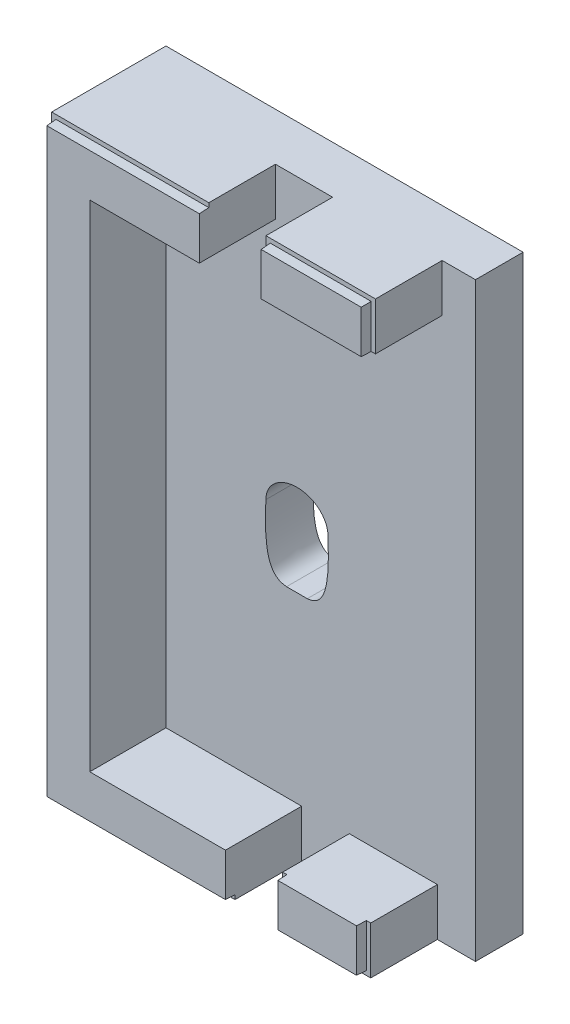
ISO-10303-21;
HEADER;
FILE_DESCRIPTION(('STEP AP214'),'2;1');
FILE_NAME('part.step','',(''),(''),'','','');
FILE_SCHEMA(('AUTOMOTIVE_DESIGN { 1 0 10303 214 1 1 1 1 }'));
ENDSEC;
DATA;
#1=APPLICATION_CONTEXT('core data for automotive mechanical design processes');
#2=APPLICATION_PROTOCOL_DEFINITION('international standard','automotive_design',2000,#1);
#3=PRODUCT_CONTEXT('',#1,'mechanical');
#4=PRODUCT('Part','Part','',(#3));
#5=PRODUCT_RELATED_PRODUCT_CATEGORY('part','',(#4));
#6=PRODUCT_DEFINITION_FORMATION('','',#4);
#7=PRODUCT_DEFINITION_CONTEXT('part definition',#1,'design');
#8=PRODUCT_DEFINITION('design','',#6,#7);
#9=PRODUCT_DEFINITION_SHAPE('','',#8);
#10=(LENGTH_UNIT() NAMED_UNIT(*) SI_UNIT(.MILLI.,.METRE.));
#11=(NAMED_UNIT(*) PLANE_ANGLE_UNIT() SI_UNIT($,.RADIAN.));
#12=(NAMED_UNIT(*) SI_UNIT($,.STERADIAN.) SOLID_ANGLE_UNIT());
#13=UNCERTAINTY_MEASURE_WITH_UNIT(LENGTH_MEASURE(1.E-05),#10,'distance_accuracy_value','');
#14=(GEOMETRIC_REPRESENTATION_CONTEXT(3) GLOBAL_UNCERTAINTY_ASSIGNED_CONTEXT((#13)) GLOBAL_UNIT_ASSIGNED_CONTEXT((#10,
#11,#12)) REPRESENTATION_CONTEXT('',''));
#15=CARTESIAN_POINT('',(0.,0.,0.));
#16=DIRECTION('',(0.,0.,1.));
#17=DIRECTION('',(1.,0.,0.));
#18=AXIS2_PLACEMENT_3D('',#15,#16,#17);
#19=CARTESIAN_POINT('',(0.,0.,10.));
#20=DIRECTION('',(0.,1.,0.));
#21=DIRECTION('',(0.,0.,1.));
#22=AXIS2_PLACEMENT_3D('',#19,#20,#21);
#23=PLANE('',#22);
#24=DIRECTION('',(1.,0.,0.));
#25=VECTOR('',#24,1.);
#26=CARTESIAN_POINT('',(0.,0.,24.));
#27=LINE('',#26,#25);
#28=CARTESIAN_POINT('',(0.,0.,24.));
#29=VERTEX_POINT('',#28);
#30=CARTESIAN_POINT('',(38.5,0.,24.));
#31=VERTEX_POINT('',#30);
#32=EDGE_CURVE('E293',#29,#31,#27,.T.);
#33=ORIENTED_EDGE('',*,*,#32,.F.);
#34=DIRECTION('',(0.,0.,-1.));
#35=VECTOR('',#34,1.);
#36=CARTESIAN_POINT('',(0.,0.,10.));
#37=LINE('',#36,#35);
#38=CARTESIAN_POINT('',(0.,0.,0.));
#39=VERTEX_POINT('',#38);
#40=EDGE_CURVE('E395',#29,#39,#37,.T.);
#41=ORIENTED_EDGE('',*,*,#40,.T.);
#42=DIRECTION('',(1.,0.,0.));
#43=VECTOR('',#42,1.);
#44=CARTESIAN_POINT('',(0.,0.,0.));
#45=LINE('',#44,#43);
#46=CARTESIAN_POINT('',(75.,0.,0.));
#47=VERTEX_POINT('',#46);
#48=EDGE_CURVE('E682',#39,#47,#45,.T.);
#49=ORIENTED_EDGE('',*,*,#48,.T.);
#50=DIRECTION('',(0.,0.,-1.));
#51=VECTOR('',#50,1.);
#52=CARTESIAN_POINT('',(75.,0.,10.));
#53=LINE('',#52,#51);
#54=CARTESIAN_POINT('',(75.,0.,10.));
#55=VERTEX_POINT('',#54);
#56=EDGE_CURVE('E567',#55,#47,#53,.T.);
#57=ORIENTED_EDGE('',*,*,#56,.F.);
#58=DIRECTION('',(1.,0.,0.));
#59=VECTOR('',#58,1.);
#60=CARTESIAN_POINT('',(0.,0.,10.));
#61=LINE('',#60,#59);
#62=CARTESIAN_POINT('',(67.,0.,10.));
#63=VERTEX_POINT('',#62);
#64=EDGE_CURVE('E565',#63,#55,#61,.T.);
#65=ORIENTED_EDGE('',*,*,#64,.F.);
#66=DIRECTION('',(0.,0.,-1.));
#67=VECTOR('',#66,1.);
#68=CARTESIAN_POINT('',(67.,0.,52.));
#69=LINE('',#68,#67);
#70=CARTESIAN_POINT('',(67.,0.,24.));
#71=VERTEX_POINT('',#70);
#72=EDGE_CURVE('E504',#71,#63,#69,.T.);
#73=ORIENTED_EDGE('',*,*,#72,.F.);
#74=DIRECTION('',(1.,0.,0.));
#75=VECTOR('',#74,1.);
#76=CARTESIAN_POINT('',(0.,0.,24.));
#77=LINE('',#76,#75);
#78=CARTESIAN_POINT('',(48.5,0.,24.));
#79=VERTEX_POINT('',#78);
#80=EDGE_CURVE('E307',#79,#71,#77,.T.);
#81=ORIENTED_EDGE('',*,*,#80,.F.);
#82=DIRECTION('',(0.,0.,-1.));
#83=VECTOR('',#82,1.);
#84=CARTESIAN_POINT('',(48.5,0.,52.));
#85=LINE('',#84,#83);
#86=CARTESIAN_POINT('',(48.5,0.,10.));
#87=VERTEX_POINT('',#86);
#88=EDGE_CURVE('E512',#79,#87,#85,.T.);
#89=ORIENTED_EDGE('',*,*,#88,.T.);
#90=CARTESIAN_POINT('',(38.5,0.,10.));
#91=VERTEX_POINT('',#90);
#92=EDGE_CURVE('E562',#91,#87,#61,.T.);
#93=ORIENTED_EDGE('',*,*,#92,.F.);
#94=DIRECTION('',(0.,0.,-1.));
#95=VECTOR('',#94,1.);
#96=CARTESIAN_POINT('',(38.5,0.,52.));
#97=LINE('',#96,#95);
#98=EDGE_CURVE('E587',#31,#91,#97,.T.);
#99=ORIENTED_EDGE('',*,*,#98,.F.);
#100=EDGE_LOOP('',(#33,#41,#49,#57,#65,#73,#81,#89,#93,#99));
#101=FACE_BOUND('',#100,.T.);
#102=ADVANCED_FACE('F35',(#101),#23,.F.);
#103=CARTESIAN_POINT('',(0.,124.,10.));
#104=DIRECTION('',(0.,1.,0.));
#105=DIRECTION('',(0.,0.,1.));
#106=AXIS2_PLACEMENT_3D('',#103,#104,#105);
#107=PLANE('',#106);
#108=DIRECTION('',(0.,0.,-1.));
#109=VECTOR('',#108,1.);
#110=CARTESIAN_POINT('',(0.,124.,10.));
#111=LINE('',#110,#109);
#112=CARTESIAN_POINT('',(0.,124.,24.));
#113=VERTEX_POINT('',#112);
#114=CARTESIAN_POINT('',(0.,124.,0.));
#115=VERTEX_POINT('',#114);
#116=EDGE_CURVE('E556',#113,#115,#111,.T.);
#117=ORIENTED_EDGE('',*,*,#116,.F.);
#118=DIRECTION('',(1.,0.,0.));
#119=VECTOR('',#118,1.);
#120=CARTESIAN_POINT('',(0.,124.,24.));
#121=LINE('',#120,#119);
#122=CARTESIAN_POINT('',(33.,124.,24.));
#123=VERTEX_POINT('',#122);
#124=EDGE_CURVE('E274',#113,#123,#121,.T.);
#125=ORIENTED_EDGE('',*,*,#124,.T.);
#126=DIRECTION('',(0.,0.,-1.));
#127=VECTOR('',#126,1.);
#128=CARTESIAN_POINT('',(33.,124.,39.));
#129=LINE('',#128,#127);
#130=CARTESIAN_POINT('',(33.,124.,10.));
#131=VERTEX_POINT('',#130);
#132=EDGE_CURVE('E548',#123,#131,#129,.T.);
#133=ORIENTED_EDGE('',*,*,#132,.T.);
#134=DIRECTION('',(1.,0.,0.));
#135=VECTOR('',#134,1.);
#136=CARTESIAN_POINT('',(0.,124.,10.));
#137=LINE('',#136,#135);
#138=CARTESIAN_POINT('',(45.,124.,10.));
#139=VERTEX_POINT('',#138);
#140=EDGE_CURVE('E676',#131,#139,#137,.T.);
#141=ORIENTED_EDGE('',*,*,#140,.T.);
#142=DIRECTION('',(0.,0.,-1.));
#143=VECTOR('',#142,1.);
#144=CARTESIAN_POINT('',(45.,124.,39.));
#145=LINE('',#144,#143);
#146=CARTESIAN_POINT('',(45.,124.,24.));
#147=VERTEX_POINT('',#146);
#148=EDGE_CURVE('E502',#147,#139,#145,.T.);
#149=ORIENTED_EDGE('',*,*,#148,.F.);
#150=DIRECTION('',(-1.,0.,0.));
#151=VECTOR('',#150,1.);
#152=CARTESIAN_POINT('',(0.,124.,24.));
#153=LINE('',#152,#151);
#154=CARTESIAN_POINT('',(68.,124.,24.));
#155=VERTEX_POINT('',#154);
#156=EDGE_CURVE('E355',#155,#147,#153,.T.);
#157=ORIENTED_EDGE('',*,*,#156,.F.);
#158=DIRECTION('',(0.,0.,-1.));
#159=VECTOR('',#158,1.);
#160=CARTESIAN_POINT('',(68.,124.,39.));
#161=LINE('',#160,#159);
#162=CARTESIAN_POINT('',(68.,124.,10.));
#163=VERTEX_POINT('',#162);
#164=EDGE_CURVE('E1131',#155,#163,#161,.T.);
#165=ORIENTED_EDGE('',*,*,#164,.T.);
#166=CARTESIAN_POINT('',(75.,124.,10.));
#167=VERTEX_POINT('',#166);
#168=EDGE_CURVE('E681',#163,#167,#137,.T.);
#169=ORIENTED_EDGE('',*,*,#168,.T.);
#170=DIRECTION('',(0.,0.,-1.));
#171=VECTOR('',#170,1.);
#172=CARTESIAN_POINT('',(75.,124.,10.));
#173=LINE('',#172,#171);
#174=CARTESIAN_POINT('',(75.,124.,0.));
#175=VERTEX_POINT('',#174);
#176=EDGE_CURVE('E412',#167,#175,#173,.T.);
#177=ORIENTED_EDGE('',*,*,#176,.T.);
#178=DIRECTION('',(1.,0.,0.));
#179=VECTOR('',#178,1.);
#180=CARTESIAN_POINT('',(0.,124.,0.));
#181=LINE('',#180,#179);
#182=EDGE_CURVE('E558',#115,#175,#181,.T.);
#183=ORIENTED_EDGE('',*,*,#182,.F.);
#184=EDGE_LOOP('',(#117,#125,#133,#141,#149,#157,#165,#169,#177,#183));
#185=FACE_BOUND('',#184,.T.);
#186=ADVANCED_FACE('F552',(#185),#107,.T.);
#187=CARTESIAN_POINT('',(0.,0.,26.));
#188=DIRECTION('',(0.,0.,1.));
#189=DIRECTION('',(1.,0.,0.));
#190=AXIS2_PLACEMENT_3D('',#187,#188,#189);
#191=PLANE('',#190);
#192=DIRECTION('',(0.,1.,0.));
#193=VECTOR('',#192,1.);
#194=CARTESIAN_POINT('',(33.,124.,26.));
#195=LINE('',#194,#193);
#196=CARTESIAN_POINT('',(33.,114.,26.));
#197=VERTEX_POINT('',#196);
#198=CARTESIAN_POINT('',(33.,123.,26.));
#199=VERTEX_POINT('',#198);
#200=EDGE_CURVE('E339',#197,#199,#195,.T.);
#201=ORIENTED_EDGE('',*,*,#200,.T.);
#202=DIRECTION('',(-1.,0.,0.));
#203=VECTOR('',#202,1.);
#204=CARTESIAN_POINT('',(0.,123.,26.));
#205=LINE('',#204,#203);
#206=CARTESIAN_POINT('',(0.999999999999972,123.,26.));
#207=VERTEX_POINT('',#206);
#208=EDGE_CURVE('E279',#199,#207,#205,.T.);
#209=ORIENTED_EDGE('',*,*,#208,.T.);
#210=DIRECTION('',(0.,-1.,0.));
#211=VECTOR('',#210,1.);
#212=CARTESIAN_POINT('',(1.,0.,26.));
#213=LINE('',#212,#211);
#214=CARTESIAN_POINT('',(1.,1.,26.));
#215=VERTEX_POINT('',#214);
#216=EDGE_CURVE('E266',#207,#215,#213,.T.);
#217=ORIENTED_EDGE('',*,*,#216,.T.);
#218=DIRECTION('',(-1.,0.,0.));
#219=VECTOR('',#218,1.);
#220=CARTESIAN_POINT('',(0.,1.,26.));
#221=LINE('',#220,#219);
#222=CARTESIAN_POINT('',(38.5,1.,26.));
#223=VERTEX_POINT('',#222);
#224=EDGE_CURVE('E257',#223,#215,#221,.T.);
#225=ORIENTED_EDGE('',*,*,#224,.F.);
#226=DIRECTION('',(0.,1.,0.));
#227=VECTOR('',#226,1.);
#228=CARTESIAN_POINT('',(38.5,0.,26.));
#229=LINE('',#228,#227);
#230=CARTESIAN_POINT('',(38.5,10.,26.));
#231=VERTEX_POINT('',#230);
#232=EDGE_CURVE('E518',#223,#231,#229,.T.);
#233=ORIENTED_EDGE('',*,*,#232,.T.);
#234=DIRECTION('',(-1.,0.,0.));
#235=VECTOR('',#234,1.);
#236=CARTESIAN_POINT('',(20.,10.,26.));
#237=LINE('',#236,#235);
#238=CARTESIAN_POINT('',(10.,10.,26.));
#239=VERTEX_POINT('',#238);
#240=EDGE_CURVE('E359',#231,#239,#237,.T.);
#241=ORIENTED_EDGE('',*,*,#240,.T.);
#242=DIRECTION('',(0.,1.,0.));
#243=VECTOR('',#242,1.);
#244=CARTESIAN_POINT('',(10.,124.,26.));
#245=LINE('',#244,#243);
#246=CARTESIAN_POINT('',(10.,114.,26.));
#247=VERTEX_POINT('',#246);
#248=EDGE_CURVE('E572',#239,#247,#245,.T.);
#249=ORIENTED_EDGE('',*,*,#248,.T.);
#250=CARTESIAN_POINT('',(33.,114.,26.));
#251=DIRECTION('',(-1.,0.,0.));
#252=VECTOR('',#251,1.);
#253=LINE('',#250,#252);
#254=EDGE_CURVE('E396',#197,#247,#253,.T.);
#255=ORIENTED_EDGE('',*,*,#254,.F.);
#256=EDGE_LOOP('',(#201,#209,#217,#225,#233,#241,#249,#255));
#257=FACE_BOUND('',#256,.T.);
#258=ADVANCED_FACE('F278',(#257),#191,.T.);
#259=CARTESIAN_POINT('',(0.,0.,10.));
#260=DIRECTION('',(-1.,0.,0.));
#261=DIRECTION('',(0.,-1.,0.));
#262=AXIS2_PLACEMENT_3D('',#259,#260,#261);
#263=PLANE('',#262);
#264=ORIENTED_EDGE('',*,*,#40,.F.);
#265=DIRECTION('',(0.,1.,0.));
#266=VECTOR('',#265,1.);
#267=CARTESIAN_POINT('',(0.,0.,24.));
#268=LINE('',#267,#266);
#269=EDGE_CURVE('E290',#29,#113,#268,.T.);
#270=ORIENTED_EDGE('',*,*,#269,.T.);
#271=ORIENTED_EDGE('',*,*,#116,.T.);
#272=DIRECTION('',(0.,1.,0.));
#273=VECTOR('',#272,1.);
#274=CARTESIAN_POINT('',(0.,0.,0.));
#275=LINE('',#274,#273);
#276=EDGE_CURVE('E679',#39,#115,#275,.T.);
#277=ORIENTED_EDGE('',*,*,#276,.F.);
#278=EDGE_LOOP('',(#264,#270,#271,#277));
#279=FACE_BOUND('',#278,.T.);
#280=ADVANCED_FACE('F698',(#279),#263,.T.);
#281=CARTESIAN_POINT('',(33.,124.,39.));
#282=DIRECTION('',(-1.,0.,0.));
#283=DIRECTION('',(0.,-1.,0.));
#284=AXIS2_PLACEMENT_3D('',#281,#282,#283);
#285=PLANE('',#284);
#286=DIRECTION('',(0.,-0.0523359562429438,0.998629534754574));
#287=VECTOR('',#286,1.);
#288=CARTESIAN_POINT('',(33.,122.323304041076,38.91212808826));
#289=LINE('',#288,#287);
#290=CARTESIAN_POINT('',(33.,123.104815558566,24.));
#291=VERTEX_POINT('',#290);
#292=EDGE_CURVE('E43',#199,#291,#289,.F.);
#293=ORIENTED_EDGE('',*,*,#292,.F.);
#294=ORIENTED_EDGE('',*,*,#200,.F.);
#295=DIRECTION('',(0.,0.,-1.));
#296=VECTOR('',#295,1.);
#297=CARTESIAN_POINT('',(33.,114.,39.));
#298=LINE('',#297,#296);
#299=CARTESIAN_POINT('',(33.,114.,10.));
#300=VERTEX_POINT('',#299);
#301=EDGE_CURVE('E601',#197,#300,#298,.T.);
#302=ORIENTED_EDGE('',*,*,#301,.T.);
#303=DIRECTION('',(0.,1.,0.));
#304=VECTOR('',#303,1.);
#305=CARTESIAN_POINT('',(33.,124.,10.));
#306=LINE('',#305,#304);
#307=EDGE_CURVE('E607',#300,#131,#306,.T.);
#308=ORIENTED_EDGE('',*,*,#307,.T.);
#309=ORIENTED_EDGE('',*,*,#132,.F.);
#310=DIRECTION('',(0.,1.,0.));
#311=VECTOR('',#310,1.);
#312=CARTESIAN_POINT('',(33.,124.,24.));
#313=LINE('',#312,#311);
#314=EDGE_CURVE('E539',#291,#123,#313,.T.);
#315=ORIENTED_EDGE('',*,*,#314,.F.);
#316=EDGE_LOOP('',(#293,#294,#302,#308,#309,#315));
#317=FACE_BOUND('',#316,.T.);
#318=ADVANCED_FACE('F484',(#317),#285,.F.);
#319=CARTESIAN_POINT('',(67.,0.,52.));
#320=DIRECTION('',(-1.,0.,0.));
#321=DIRECTION('',(0.,0.,1.));
#322=AXIS2_PLACEMENT_3D('',#319,#320,#321);
#323=PLANE('',#322);
#324=DIRECTION('',(0.,1.,0.));
#325=VECTOR('',#324,1.);
#326=CARTESIAN_POINT('',(67.,0.,24.));
#327=LINE('',#326,#325);
#328=CARTESIAN_POINT('',(67.,10.,24.));
#329=VERTEX_POINT('',#328);
#330=EDGE_CURVE('E319',#71,#329,#327,.T.);
#331=ORIENTED_EDGE('',*,*,#330,.F.);
#332=ORIENTED_EDGE('',*,*,#72,.T.);
#333=DIRECTION('',(0.,1.,0.));
#334=VECTOR('',#333,1.);
#335=CARTESIAN_POINT('',(67.,0.,10.));
#336=LINE('',#335,#334);
#337=CARTESIAN_POINT('',(67.,10.,10.));
#338=VERTEX_POINT('',#337);
#339=EDGE_CURVE('E652',#63,#338,#336,.T.);
#340=ORIENTED_EDGE('',*,*,#339,.T.);
#341=DIRECTION('',(0.,0.,-1.));
#342=VECTOR('',#341,1.);
#343=CARTESIAN_POINT('',(67.,10.,52.));
#344=LINE('',#343,#342);
#345=EDGE_CURVE('E511',#329,#338,#344,.T.);
#346=ORIENTED_EDGE('',*,*,#345,.F.);
#347=EDGE_LOOP('',(#331,#332,#340,#346));
#348=FACE_BOUND('',#347,.T.);
#349=ADVANCED_FACE('F480',(#348),#323,.F.);
#350=CARTESIAN_POINT('',(48.5,0.,52.));
#351=DIRECTION('',(1.,0.,0.));
#352=DIRECTION('',(0.,0.,-1.));
#353=AXIS2_PLACEMENT_3D('',#350,#351,#352);
#354=PLANE('',#353);
#355=DIRECTION('',(0.,-1.,0.));
#356=VECTOR('',#355,1.);
#357=CARTESIAN_POINT('',(48.5,0.,24.));
#358=LINE('',#357,#356);
#359=CARTESIAN_POINT('',(48.5,10.,24.));
#360=VERTEX_POINT('',#359);
#361=EDGE_CURVE('E530',#360,#79,#358,.T.);
#362=ORIENTED_EDGE('',*,*,#361,.F.);
#363=DIRECTION('',(0.,0.,-1.));
#364=VECTOR('',#363,1.);
#365=CARTESIAN_POINT('',(48.5,10.,52.));
#366=LINE('',#365,#364);
#367=CARTESIAN_POINT('',(48.5,10.,10.));
#368=VERTEX_POINT('',#367);
#369=EDGE_CURVE('E524',#360,#368,#366,.T.);
#370=ORIENTED_EDGE('',*,*,#369,.T.);
#371=DIRECTION('',(0.,-1.,0.));
#372=VECTOR('',#371,1.);
#373=CARTESIAN_POINT('',(48.5,0.,10.));
#374=LINE('',#373,#372);
#375=EDGE_CURVE('E439',#368,#87,#374,.T.);
#376=ORIENTED_EDGE('',*,*,#375,.T.);
#377=ORIENTED_EDGE('',*,*,#88,.F.);
#378=EDGE_LOOP('',(#362,#370,#376,#377));
#379=FACE_BOUND('',#378,.T.);
#380=ADVANCED_FACE('F466',(#379),#354,.F.);
#381=CARTESIAN_POINT('',(45.,124.,39.));
#382=DIRECTION('',(1.,0.,0.));
#383=DIRECTION('',(0.,0.,-1.));
#384=AXIS2_PLACEMENT_3D('',#381,#382,#383);
#385=PLANE('',#384);
#386=DIRECTION('',(0.,1.,0.));
#387=VECTOR('',#386,1.);
#388=CARTESIAN_POINT('',(45.,0.,24.));
#389=LINE('',#388,#387);
#390=CARTESIAN_POINT('',(45.,114.,24.));
#391=VERTEX_POINT('',#390);
#392=EDGE_CURVE('E334',#391,#147,#389,.T.);
#393=ORIENTED_EDGE('',*,*,#392,.T.);
#394=ORIENTED_EDGE('',*,*,#148,.T.);
#395=DIRECTION('',(0.,-1.,0.));
#396=VECTOR('',#395,1.);
#397=CARTESIAN_POINT('',(45.,124.,10.));
#398=LINE('',#397,#396);
#399=CARTESIAN_POINT('',(45.,114.,10.));
#400=VERTEX_POINT('',#399);
#401=EDGE_CURVE('E632',#139,#400,#398,.T.);
#402=ORIENTED_EDGE('',*,*,#401,.T.);
#403=DIRECTION('',(0.,0.,-1.));
#404=VECTOR('',#403,1.);
#405=CARTESIAN_POINT('',(45.,114.,39.));
#406=LINE('',#405,#404);
#407=EDGE_CURVE('E612',#391,#400,#406,.T.);
#408=ORIENTED_EDGE('',*,*,#407,.F.);
#409=EDGE_LOOP('',(#393,#394,#402,#408));
#410=FACE_BOUND('',#409,.T.);
#411=ADVANCED_FACE('F463',(#410),#385,.F.);
#412=CARTESIAN_POINT('',(68.,124.,39.));
#413=DIRECTION('',(-1.,0.,0.));
#414=DIRECTION('',(0.,0.,1.));
#415=AXIS2_PLACEMENT_3D('',#412,#413,#414);
#416=PLANE('',#415);
#417=DIRECTION('',(0.,-1.,0.));
#418=VECTOR('',#417,1.);
#419=CARTESIAN_POINT('',(68.,0.,24.));
#420=LINE('',#419,#418);
#421=CARTESIAN_POINT('',(68.,114.,24.));
#422=VERTEX_POINT('',#421);
#423=EDGE_CURVE('E338',#155,#422,#420,.T.);
#424=ORIENTED_EDGE('',*,*,#423,.T.);
#425=DIRECTION('',(0.,0.,-1.));
#426=VECTOR('',#425,1.);
#427=CARTESIAN_POINT('',(68.,114.,39.));
#428=LINE('',#427,#426);
#429=CARTESIAN_POINT('',(68.,114.,10.));
#430=VERTEX_POINT('',#429);
#431=EDGE_CURVE('E399',#422,#430,#428,.T.);
#432=ORIENTED_EDGE('',*,*,#431,.T.);
#433=DIRECTION('',(0.,1.,0.));
#434=VECTOR('',#433,1.);
#435=CARTESIAN_POINT('',(68.,124.,10.));
#436=LINE('',#435,#434);
#437=EDGE_CURVE('E642',#430,#163,#436,.T.);
#438=ORIENTED_EDGE('',*,*,#437,.T.);
#439=ORIENTED_EDGE('',*,*,#164,.F.);
#440=EDGE_LOOP('',(#424,#432,#438,#439));
#441=FACE_BOUND('',#440,.T.);
#442=ADVANCED_FACE('F459',(#441),#416,.F.);
#443=DIRECTION('',(0.,1.,0.));
#444=VECTOR('',#443,1.);
#445=CARTESIAN_POINT('',(49.5,0.,26.));
#446=LINE('',#445,#444);
#447=CARTESIAN_POINT('',(49.5,1.,26.));
#448=VERTEX_POINT('',#447);
#449=CARTESIAN_POINT('',(49.5,10.,26.));
#450=VERTEX_POINT('',#449);
#451=EDGE_CURVE('E302',#448,#450,#446,.T.);
#452=ORIENTED_EDGE('',*,*,#451,.F.);
#453=DIRECTION('',(-1.,0.,0.));
#454=VECTOR('',#453,1.);
#455=CARTESIAN_POINT('',(0.,1.,26.));
#456=LINE('',#455,#454);
#457=CARTESIAN_POINT('',(66.,1.,26.));
#458=VERTEX_POINT('',#457);
#459=EDGE_CURVE('E299',#458,#448,#456,.T.);
#460=ORIENTED_EDGE('',*,*,#459,.F.);
#461=DIRECTION('',(0.,-1.,0.));
#462=VECTOR('',#461,1.);
#463=CARTESIAN_POINT('',(66.,0.,26.));
#464=LINE('',#463,#462);
#465=CARTESIAN_POINT('',(66.,10.,26.));
#466=VERTEX_POINT('',#465);
#467=EDGE_CURVE('E297',#466,#458,#464,.T.);
#468=ORIENTED_EDGE('',*,*,#467,.F.);
#469=DIRECTION('',(-1.,0.,0.));
#470=VECTOR('',#469,1.);
#471=CARTESIAN_POINT('',(48.5,10.,26.));
#472=LINE('',#471,#470);
#473=EDGE_CURVE('E515',#466,#450,#472,.T.);
#474=ORIENTED_EDGE('',*,*,#473,.T.);
#475=EDGE_LOOP('',(#452,#460,#468,#474));
#476=FACE_BOUND('',#475,.T.);
#477=ADVANCED_FACE('F470',(#476),#191,.T.);
#478=DIRECTION('',(0.,1.,0.));
#479=VECTOR('',#478,1.);
#480=CARTESIAN_POINT('',(46.,0.,26.));
#481=LINE('',#480,#479);
#482=CARTESIAN_POINT('',(46.,114.,26.));
#483=VERTEX_POINT('',#482);
#484=CARTESIAN_POINT('',(46.,123.,26.));
#485=VERTEX_POINT('',#484);
#486=EDGE_CURVE('E360',#483,#485,#481,.T.);
#487=ORIENTED_EDGE('',*,*,#486,.F.);
#488=CARTESIAN_POINT('',(67.,114.,26.));
#489=DIRECTION('',(-1.,0.,0.));
#490=VECTOR('',#489,1.);
#491=LINE('',#488,#490);
#492=CARTESIAN_POINT('',(67.,114.,26.));
#493=VERTEX_POINT('',#492);
#494=EDGE_CURVE('E387',#493,#483,#491,.T.);
#495=ORIENTED_EDGE('',*,*,#494,.F.);
#496=DIRECTION('',(0.,-1.,0.));
#497=VECTOR('',#496,1.);
#498=CARTESIAN_POINT('',(67.,0.,26.));
#499=LINE('',#498,#497);
#500=CARTESIAN_POINT('',(67.,123.,26.));
#501=VERTEX_POINT('',#500);
#502=EDGE_CURVE('E356',#501,#493,#499,.T.);
#503=ORIENTED_EDGE('',*,*,#502,.F.);
#504=DIRECTION('',(-1.,0.,0.));
#505=VECTOR('',#504,1.);
#506=CARTESIAN_POINT('',(0.,123.,26.));
#507=LINE('',#506,#505);
#508=EDGE_CURVE('E345',#501,#485,#507,.T.);
#509=ORIENTED_EDGE('',*,*,#508,.T.);
#510=EDGE_LOOP('',(#487,#495,#503,#509));
#511=FACE_BOUND('',#510,.T.);
#512=ADVANCED_FACE('F386',(#511),#191,.T.);
#513=CARTESIAN_POINT('',(35.3205360374278,48.3282784351919,52.001));
#514=CARTESIAN_POINT('',(31.940368492597,48.6088043462592,52.001));
#515=CARTESIAN_POINT('',(30.4948835545121,51.7516643831495,52.001));
#516=CARTESIAN_POINT('',(30.9840812231567,62.,52.001));
#517=B_SPLINE_CURVE_WITH_KNOTS('',3,(#513,#514,#515,#516),.UNSPECIFIED.,.F.,.F.,(4,4),
(0.162125932616789,1.),.UNSPECIFIED.);
#518=DIRECTION('',(0.,0.,-1.));
#519=VECTOR('',#518,1.);
#520=SURFACE_OF_LINEAR_EXTRUSION('',#517,#519);
#521=CARTESIAN_POINT('',(35.3205360374278,48.3282784351919,10.));
#522=CARTESIAN_POINT('',(31.940368492597,48.6088043462592,10.));
#523=CARTESIAN_POINT('',(30.4948835545121,51.7516643831495,10.));
#524=CARTESIAN_POINT('',(30.9840812231567,62.,10.));
#525=B_SPLINE_CURVE_WITH_KNOTS('',3,(#521,#522,#523,#524),.UNSPECIFIED.,.F.,.F.,(4,4),
(0.162125932616789,1.),.UNSPECIFIED.);
#526=CARTESIAN_POINT('',(30.9840812231567,62.,10.));
#527=VERTEX_POINT('',#526);
#528=CARTESIAN_POINT('',(35.3205360374278,48.328278435192,10.));
#529=VERTEX_POINT('',#528);
#530=EDGE_CURVE('E590',#527,#529,#525,.F.);
#531=ORIENTED_EDGE('',*,*,#530,.T.);
#532=DIRECTION('',(0.,0.,-1.));
#533=VECTOR('',#532,1.);
#534=CARTESIAN_POINT('',(35.3205360374278,48.328278435192,52.001));
#535=LINE('',#534,#533);
#536=CARTESIAN_POINT('',(35.3205360374278,48.328278435192,0.));
#537=VERTEX_POINT('',#536);
#538=EDGE_CURVE('E1114',#529,#537,#535,.T.);
#539=ORIENTED_EDGE('',*,*,#538,.T.);
#540=CARTESIAN_POINT('',(35.3205360374278,48.3282784351919,0.));
#541=CARTESIAN_POINT('',(31.940368492597,48.6088043462592,0.));
#542=CARTESIAN_POINT('',(30.4948835545121,51.7516643831495,0.));
#543=CARTESIAN_POINT('',(30.9840812231567,62.,0.));
#544=B_SPLINE_CURVE_WITH_KNOTS('',3,(#540,#541,#542,#543),.UNSPECIFIED.,.F.,.F.,(4,4),
(0.162125932616789,1.),.UNSPECIFIED.);
#545=CARTESIAN_POINT('',(30.9840812231567,62.,0.));
#546=VERTEX_POINT('',#545);
#547=EDGE_CURVE('E1121',#537,#546,#544,.T.);
#548=ORIENTED_EDGE('',*,*,#547,.T.);
#549=DIRECTION('',(0.,0.,-1.));
#550=VECTOR('',#549,1.);
#551=CARTESIAN_POINT('',(30.9840812231567,62.,52.001));
#552=LINE('',#551,#550);
#553=EDGE_CURVE('E1085',#527,#546,#552,.T.);
#554=ORIENTED_EDGE('',*,*,#553,.F.);
#555=EDGE_LOOP('',(#531,#539,#548,#554));
#556=FACE_BOUND('',#555,.T.);
#557=ADVANCED_FACE('F455',(#556),#520,.F.);
#558=CARTESIAN_POINT('',(39.6794639625724,48.328278435192,52.001));
#559=DIRECTION('',(0.,-1.,0.));
#560=DIRECTION('',(0.,0.,-1.));
#561=AXIS2_PLACEMENT_3D('',#558,#559,#560);
#562=PLANE('',#561);
#563=DIRECTION('',(1.,0.,0.));
#564=VECTOR('',#563,1.);
#565=CARTESIAN_POINT('',(39.6794639625724,48.328278435192,10.));
#566=LINE('',#565,#564);
#567=CARTESIAN_POINT('',(39.6794639625724,48.328278435192,10.));
#568=VERTEX_POINT('',#567);
#569=EDGE_CURVE('E1094',#529,#568,#566,.T.);
#570=ORIENTED_EDGE('',*,*,#569,.T.);
#571=DIRECTION('',(0.,0.,-1.));
#572=VECTOR('',#571,1.);
#573=CARTESIAN_POINT('',(39.6794639625724,48.328278435192,52.001));
#574=LINE('',#573,#572);
#575=CARTESIAN_POINT('',(39.6794639625724,48.328278435192,0.));
#576=VERTEX_POINT('',#575);
#577=EDGE_CURVE('E450',#568,#576,#574,.T.);
#578=ORIENTED_EDGE('',*,*,#577,.T.);
#579=DIRECTION('',(-1.,0.,0.));
#580=VECTOR('',#579,1.);
#581=CARTESIAN_POINT('',(39.6794639625724,48.328278435192,0.));
#582=LINE('',#581,#580);
#583=EDGE_CURVE('E1115',#576,#537,#582,.T.);
#584=ORIENTED_EDGE('',*,*,#583,.T.);
#585=ORIENTED_EDGE('',*,*,#538,.F.);
#586=EDGE_LOOP('',(#570,#578,#584,#585));
#587=FACE_BOUND('',#586,.T.);
#588=ADVANCED_FACE('F431',(#587),#562,.F.);
#589=CARTESIAN_POINT('',(44.0159187768433,62.,52.001));
#590=CARTESIAN_POINT('',(44.5051164454887,51.7516643831514,52.001));
#591=CARTESIAN_POINT('',(43.0596315074031,48.6088043462593,52.001));
#592=CARTESIAN_POINT('',(39.6794639625725,48.3282784351919,52.001));
#593=B_SPLINE_CURVE_WITH_KNOTS('',3,(#589,#590,#591,#592),.UNSPECIFIED.,.F.,.F.,(4,4),
(0.162125932616804,1.),.UNSPECIFIED.);
#594=DIRECTION('',(0.,0.,-1.));
#595=VECTOR('',#594,1.);
#596=SURFACE_OF_LINEAR_EXTRUSION('',#593,#595);
#597=CARTESIAN_POINT('',(44.0159187768433,62.,10.));
#598=CARTESIAN_POINT('',(44.5051164454887,51.7516643831514,10.));
#599=CARTESIAN_POINT('',(43.0596315074031,48.6088043462593,10.));
#600=CARTESIAN_POINT('',(39.6794639625725,48.3282784351919,10.));
#601=B_SPLINE_CURVE_WITH_KNOTS('',3,(#597,#598,#599,#600),.UNSPECIFIED.,.F.,.F.,(4,4),
(0.162125932616804,1.),.UNSPECIFIED.);
#602=CARTESIAN_POINT('',(44.0159187768433,62.,10.));
#603=VERTEX_POINT('',#602);
#604=EDGE_CURVE('E1090',#568,#603,#601,.F.);
#605=ORIENTED_EDGE('',*,*,#604,.T.);
#606=DIRECTION('',(0.,0.,-1.));
#607=VECTOR('',#606,1.);
#608=CARTESIAN_POINT('',(44.0159187768433,62.,52.001));
#609=LINE('',#608,#607);
#610=CARTESIAN_POINT('',(44.0159187768433,62.,0.));
#611=VERTEX_POINT('',#610);
#612=EDGE_CURVE('E1087',#603,#611,#609,.T.);
#613=ORIENTED_EDGE('',*,*,#612,.T.);
#614=CARTESIAN_POINT('',(44.0159187768433,62.,0.));
#615=CARTESIAN_POINT('',(44.5051164454887,51.7516643831514,0.));
#616=CARTESIAN_POINT('',(43.0596315074031,48.6088043462593,0.));
#617=CARTESIAN_POINT('',(39.6794639625725,48.3282784351919,0.));
#618=B_SPLINE_CURVE_WITH_KNOTS('',3,(#614,#615,#616,#617),.UNSPECIFIED.,.F.,.F.,(4,4),
(0.162125932616804,1.),.UNSPECIFIED.);
#619=EDGE_CURVE('E1107',#611,#576,#618,.T.);
#620=ORIENTED_EDGE('',*,*,#619,.T.);
#621=ORIENTED_EDGE('',*,*,#577,.F.);
#622=EDGE_LOOP('',(#605,#613,#620,#621));
#623=FACE_BOUND('',#622,.T.);
#624=ADVANCED_FACE('F426',(#623),#596,.F.);
#625=CARTESIAN_POINT('',(37.5,62.,52.001));
#626=DIRECTION('',(0.,0.,-1.));
#627=DIRECTION('',(-1.,0.,0.));
#628=AXIS2_PLACEMENT_3D('',#625,#626,#627);
#629=ELLIPSE('',#628,6.51591877684335,5.50395470143701);
#630=DIRECTION('',(0.,0.,-1.));
#631=VECTOR('',#630,1.);
#632=SURFACE_OF_LINEAR_EXTRUSION('',#629,#631);
#633=CARTESIAN_POINT('',(37.5,62.,10.));
#634=DIRECTION('',(0.,0.,-1.));
#635=DIRECTION('',(-1.,0.,0.));
#636=AXIS2_PLACEMENT_3D('',#633,#634,#635);
#637=ELLIPSE('',#636,6.51591877684335,5.50395470143701);
#638=EDGE_CURVE('E1082',#603,#527,#637,.F.);
#639=ORIENTED_EDGE('',*,*,#638,.T.);
#640=ORIENTED_EDGE('',*,*,#553,.T.);
#641=CARTESIAN_POINT('',(37.5,62.,0.));
#642=DIRECTION('',(0.,0.,-1.));
#643=DIRECTION('',(-1.,0.,0.));
#644=AXIS2_PLACEMENT_3D('',#641,#642,#643);
#645=ELLIPSE('',#644,6.51591877684335,5.50395470143701);
#646=EDGE_CURVE('E1125',#546,#611,#645,.T.);
#647=ORIENTED_EDGE('',*,*,#646,.T.);
#648=ORIENTED_EDGE('',*,*,#612,.F.);
#649=EDGE_LOOP('',(#639,#640,#647,#648));
#650=FACE_BOUND('',#649,.T.);
#651=ADVANCED_FACE('F430',(#650),#632,.F.);
#652=CARTESIAN_POINT('',(38.5,0.,52.));
#653=DIRECTION('',(-1.,0.,0.));
#654=DIRECTION('',(0.,0.,1.));
#655=AXIS2_PLACEMENT_3D('',#652,#653,#654);
#656=PLANE('',#655);
#657=ORIENTED_EDGE('',*,*,#232,.F.);
#658=DIRECTION('',(0.,-0.0523359562429438,-0.998629534754574));
#659=VECTOR('',#658,1.);
#660=CARTESIAN_POINT('',(38.5,2.35613097016363,51.8765204081537));
#661=LINE('',#660,#659);
#662=CARTESIAN_POINT('',(38.5,0.895184441433918,24.));
#663=VERTEX_POINT('',#662);
#664=EDGE_CURVE('E12',#223,#663,#661,.T.);
#665=ORIENTED_EDGE('',*,*,#664,.T.);
#666=DIRECTION('',(0.,1.,0.));
#667=VECTOR('',#666,1.);
#668=CARTESIAN_POINT('',(38.5,0.,24.));
#669=LINE('',#668,#667);
#670=EDGE_CURVE('E295',#31,#663,#669,.T.);
#671=ORIENTED_EDGE('',*,*,#670,.F.);
#672=ORIENTED_EDGE('',*,*,#98,.T.);
#673=DIRECTION('',(0.,1.,0.));
#674=VECTOR('',#673,1.);
#675=CARTESIAN_POINT('',(38.5,0.,10.));
#676=LINE('',#675,#674);
#677=CARTESIAN_POINT('',(38.5,10.,10.));
#678=VERTEX_POINT('',#677);
#679=EDGE_CURVE('E514',#91,#678,#676,.T.);
#680=ORIENTED_EDGE('',*,*,#679,.T.);
#681=DIRECTION('',(0.,0.,-1.));
#682=VECTOR('',#681,1.);
#683=CARTESIAN_POINT('',(38.5,10.,52.));
#684=LINE('',#683,#682);
#685=EDGE_CURVE('E584',#231,#678,#684,.T.);
#686=ORIENTED_EDGE('',*,*,#685,.F.);
#687=EDGE_LOOP('',(#657,#665,#671,#672,#680,#686));
#688=FACE_BOUND('',#687,.T.);
#689=ADVANCED_FACE('F490',(#688),#656,.F.);
#690=CARTESIAN_POINT('',(0.,0.,0.));
#691=DIRECTION('',(0.,0.,-1.));
#692=DIRECTION('',(-1.,0.,0.));
#693=AXIS2_PLACEMENT_3D('',#690,#691,#692);
#694=PLANE('',#693);
#695=ORIENTED_EDGE('',*,*,#619,.F.);
#696=ORIENTED_EDGE('',*,*,#646,.F.);
#697=ORIENTED_EDGE('',*,*,#547,.F.);
#698=ORIENTED_EDGE('',*,*,#583,.F.);
#699=EDGE_LOOP('',(#695,#696,#697,#698));
#700=FACE_BOUND('',#699,.T.);
#701=ORIENTED_EDGE('',*,*,#276,.T.);
#702=ORIENTED_EDGE('',*,*,#182,.T.);
#703=DIRECTION('',(0.,1.,0.));
#704=VECTOR('',#703,1.);
#705=CARTESIAN_POINT('',(75.,0.,0.));
#706=LINE('',#705,#704);
#707=EDGE_CURVE('E683',#47,#175,#706,.T.);
#708=ORIENTED_EDGE('',*,*,#707,.F.);
#709=ORIENTED_EDGE('',*,*,#48,.F.);
#710=EDGE_LOOP('',(#701,#702,#708,#709));
#711=FACE_BOUND('',#710,.T.);
#712=ADVANCED_FACE('F705',(#700,#711),#694,.T.);
#713=CARTESIAN_POINT('',(75.,0.,10.));
#714=DIRECTION('',(-1.,0.,0.));
#715=DIRECTION('',(0.,-1.,0.));
#716=AXIS2_PLACEMENT_3D('',#713,#714,#715);
#717=PLANE('',#716);
#718=ORIENTED_EDGE('',*,*,#707,.T.);
#719=ORIENTED_EDGE('',*,*,#176,.F.);
#720=DIRECTION('',(0.,1.,0.));
#721=VECTOR('',#720,1.);
#722=CARTESIAN_POINT('',(75.,0.,10.));
#723=LINE('',#722,#721);
#724=EDGE_CURVE('E675',#55,#167,#723,.T.);
#725=ORIENTED_EDGE('',*,*,#724,.F.);
#726=ORIENTED_EDGE('',*,*,#56,.T.);
#727=EDGE_LOOP('',(#718,#719,#725,#726));
#728=FACE_BOUND('',#727,.T.);
#729=ADVANCED_FACE('F476',(#728),#717,.F.);
#730=CARTESIAN_POINT('',(48.5,10.,52.));
#731=DIRECTION('',(0.,-1.,0.));
#732=DIRECTION('',(0.,0.,-1.));
#733=AXIS2_PLACEMENT_3D('',#730,#731,#732);
#734=PLANE('',#733);
#735=ORIENTED_EDGE('',*,*,#473,.F.);
#736=DIRECTION('',(0.0523359562429438,0.,-0.998629534754574));
#737=VECTOR('',#736,1.);
#738=CARTESIAN_POINT('',(64.5931965619929,10.,52.8434086933795));
#739=LINE('',#738,#737);
#740=CARTESIAN_POINT('',(66.1048155585661,10.,24.));
#741=VERTEX_POINT('',#740);
#742=EDGE_CURVE('E536',#466,#741,#739,.T.);
#743=ORIENTED_EDGE('',*,*,#742,.T.);
#744=DIRECTION('',(-1.,0.,0.));
#745=VECTOR('',#744,1.);
#746=CARTESIAN_POINT('',(48.5,10.,24.));
#747=LINE('',#746,#745);
#748=EDGE_CURVE('E320',#329,#741,#747,.T.);
#749=ORIENTED_EDGE('',*,*,#748,.F.);
#750=ORIENTED_EDGE('',*,*,#345,.T.);
#751=DIRECTION('',(-1.,0.,0.));
#752=VECTOR('',#751,1.);
#753=CARTESIAN_POINT('',(48.5,10.,10.));
#754=LINE('',#753,#752);
#755=EDGE_CURVE('E527',#338,#368,#754,.T.);
#756=ORIENTED_EDGE('',*,*,#755,.T.);
#757=ORIENTED_EDGE('',*,*,#369,.F.);
#758=CARTESIAN_POINT('',(49.3951844414339,10.,24.));
#759=VERTEX_POINT('',#758);
#760=EDGE_CURVE('E58',#759,#360,#747,.T.);
#761=ORIENTED_EDGE('',*,*,#760,.F.);
#762=DIRECTION('',(0.0523359562429438,0.,0.998629534754574));
#763=VECTOR('',#762,1.);
#764=CARTESIAN_POINT('',(50.8561309701636,10.,51.8765204081537));
#765=LINE('',#764,#763);
#766=EDGE_CURVE('E532',#759,#450,#765,.T.);
#767=ORIENTED_EDGE('',*,*,#766,.T.);
#768=EDGE_LOOP('',(#735,#743,#749,#750,#756,#757,#761,#767));
#769=FACE_BOUND('',#768,.T.);
#770=ADVANCED_FACE('F472',(#769),#734,.F.);
#771=CARTESIAN_POINT('',(0.,0.,10.));
#772=DIRECTION('',(0.,0.,-1.));
#773=DIRECTION('',(-1.,0.,0.));
#774=AXIS2_PLACEMENT_3D('',#771,#772,#773);
#775=PLANE('',#774);
#776=ORIENTED_EDGE('',*,*,#638,.F.);
#777=ORIENTED_EDGE('',*,*,#604,.F.);
#778=ORIENTED_EDGE('',*,*,#569,.F.);
#779=ORIENTED_EDGE('',*,*,#530,.F.);
#780=EDGE_LOOP('',(#776,#777,#778,#779));
#781=FACE_BOUND('',#780,.T.);
#782=DIRECTION('',(0.,1.,0.));
#783=VECTOR('',#782,1.);
#784=CARTESIAN_POINT('',(10.,124.,10.));
#785=LINE('',#784,#783);
#786=CARTESIAN_POINT('',(10.,9.99999999999999,10.));
#787=VERTEX_POINT('',#786);
#788=CARTESIAN_POINT('',(10.,114.,10.));
#789=VERTEX_POINT('',#788);
#790=EDGE_CURVE('E635',#787,#789,#785,.T.);
#791=ORIENTED_EDGE('',*,*,#790,.F.);
#792=DIRECTION('',(-1.,0.,0.));
#793=VECTOR('',#792,1.);
#794=CARTESIAN_POINT('',(20.,10.,10.));
#795=LINE('',#794,#793);
#796=EDGE_CURVE('E586',#678,#787,#795,.T.);
#797=ORIENTED_EDGE('',*,*,#796,.F.);
#798=ORIENTED_EDGE('',*,*,#679,.F.);
#799=ORIENTED_EDGE('',*,*,#92,.T.);
#800=ORIENTED_EDGE('',*,*,#375,.F.);
#801=ORIENTED_EDGE('',*,*,#755,.F.);
#802=ORIENTED_EDGE('',*,*,#339,.F.);
#803=ORIENTED_EDGE('',*,*,#64,.T.);
#804=ORIENTED_EDGE('',*,*,#724,.T.);
#805=ORIENTED_EDGE('',*,*,#168,.F.);
#806=ORIENTED_EDGE('',*,*,#437,.F.);
#807=DIRECTION('',(1.,0.,0.));
#808=VECTOR('',#807,1.);
#809=CARTESIAN_POINT('',(45.,114.,10.));
#810=LINE('',#809,#808);
#811=EDGE_CURVE('E636',#400,#430,#810,.T.);
#812=ORIENTED_EDGE('',*,*,#811,.F.);
#813=ORIENTED_EDGE('',*,*,#401,.F.);
#814=ORIENTED_EDGE('',*,*,#140,.F.);
#815=ORIENTED_EDGE('',*,*,#307,.F.);
#816=DIRECTION('',(1.,0.,0.));
#817=VECTOR('',#816,1.);
#818=CARTESIAN_POINT('',(10.,114.,10.));
#819=LINE('',#818,#817);
#820=EDGE_CURVE('E609',#789,#300,#819,.T.);
#821=ORIENTED_EDGE('',*,*,#820,.F.);
#822=EDGE_LOOP('',(#791,#797,#798,#799,#800,#801,#802,#803,#804,#805,#806,#812,#813,#814,#815,#821));
#823=FACE_BOUND('',#822,.T.);
#824=ADVANCED_FACE('F475',(#781,#823),#775,.F.);
#825=CARTESIAN_POINT('',(10.,124.,52.));
#826=DIRECTION('',(-1.,0.,0.));
#827=DIRECTION('',(0.,-1.,0.));
#828=AXIS2_PLACEMENT_3D('',#825,#826,#827);
#829=PLANE('',#828);
#830=ORIENTED_EDGE('',*,*,#248,.F.);
#831=DIRECTION('',(0.,0.,1.));
#832=VECTOR('',#831,1.);
#833=CARTESIAN_POINT('',(10.,10.,-0.002000000000002));
#834=LINE('',#833,#832);
#835=EDGE_CURVE('E588',#787,#239,#834,.T.);
#836=ORIENTED_EDGE('',*,*,#835,.F.);
#837=ORIENTED_EDGE('',*,*,#790,.T.);
#838=DIRECTION('',(0.,0.,-1.));
#839=VECTOR('',#838,1.);
#840=CARTESIAN_POINT('',(10.,114.,39.));
#841=LINE('',#840,#839);
#842=EDGE_CURVE('E409',#247,#789,#841,.T.);
#843=ORIENTED_EDGE('',*,*,#842,.F.);
#844=EDGE_LOOP('',(#830,#836,#837,#843));
#845=FACE_BOUND('',#844,.T.);
#846=ADVANCED_FACE('F690',(#845),#829,.F.);
#847=CARTESIAN_POINT('',(10.,114.,39.));
#848=DIRECTION('',(0.,1.,0.));
#849=DIRECTION('',(0.,0.,1.));
#850=AXIS2_PLACEMENT_3D('',#847,#848,#849);
#851=PLANE('',#850);
#852=ORIENTED_EDGE('',*,*,#301,.F.);
#853=ORIENTED_EDGE('',*,*,#254,.T.);
#854=ORIENTED_EDGE('',*,*,#842,.T.);
#855=ORIENTED_EDGE('',*,*,#820,.T.);
#856=EDGE_LOOP('',(#852,#853,#854,#855));
#857=FACE_BOUND('',#856,.T.);
#858=ADVANCED_FACE('F423',(#857),#851,.F.);
#859=CARTESIAN_POINT('',(45.,114.,39.));
#860=DIRECTION('',(0.,1.,0.));
#861=DIRECTION('',(0.,0.,1.));
#862=AXIS2_PLACEMENT_3D('',#859,#860,#861);
#863=PLANE('',#862);
#864=ORIENTED_EDGE('',*,*,#494,.T.);
#865=DIRECTION('',(-0.0523359562429438,0.,-0.998629534754574));
#866=VECTOR('',#865,1.);
#867=CARTESIAN_POINT('',(46.6766959589239,114.,38.91212808826));
#868=LINE('',#867,#866);
#869=CARTESIAN_POINT('',(45.8951844414339,114.,24.));
#870=VERTEX_POINT('',#869);
#871=EDGE_CURVE('E383',#483,#870,#868,.T.);
#872=ORIENTED_EDGE('',*,*,#871,.T.);
#873=DIRECTION('',(1.,0.,0.));
#874=VECTOR('',#873,1.);
#875=CARTESIAN_POINT('',(45.,114.,24.));
#876=LINE('',#875,#874);
#877=EDGE_CURVE('E624',#391,#870,#876,.T.);
#878=ORIENTED_EDGE('',*,*,#877,.F.);
#879=ORIENTED_EDGE('',*,*,#407,.T.);
#880=ORIENTED_EDGE('',*,*,#811,.T.);
#881=ORIENTED_EDGE('',*,*,#431,.F.);
#882=CARTESIAN_POINT('',(67.1048155585661,114.,24.));
#883=VERTEX_POINT('',#882);
#884=EDGE_CURVE('E617',#883,#422,#876,.T.);
#885=ORIENTED_EDGE('',*,*,#884,.F.);
#886=DIRECTION('',(-0.0523359562429438,0.,0.998629534754574));
#887=VECTOR('',#886,1.);
#888=CARTESIAN_POINT('',(66.2603058378113,114.,40.114205415838));
#889=LINE('',#888,#887);
#890=EDGE_CURVE('E394',#883,#493,#889,.T.);
#891=ORIENTED_EDGE('',*,*,#890,.T.);
#892=EDGE_LOOP('',(#864,#872,#878,#879,#880,#881,#885,#891));
#893=FACE_BOUND('',#892,.T.);
#894=ADVANCED_FACE('F391',(#893),#863,.F.);
#895=CARTESIAN_POINT('',(20.,10.,52.));
#896=DIRECTION('',(0.,-1.,0.));
#897=DIRECTION('',(0.,0.,-1.));
#898=AXIS2_PLACEMENT_3D('',#895,#896,#897);
#899=PLANE('',#898);
#900=ORIENTED_EDGE('',*,*,#240,.F.);
#901=ORIENTED_EDGE('',*,*,#685,.T.);
#902=ORIENTED_EDGE('',*,*,#796,.T.);
#903=ORIENTED_EDGE('',*,*,#835,.T.);
#904=EDGE_LOOP('',(#900,#901,#902,#903));
#905=FACE_BOUND('',#904,.T.);
#906=ADVANCED_FACE('F37',(#905),#899,.F.);
#907=CARTESIAN_POINT('',(46.,0.,26.));
#908=DIRECTION('',(0.998629534754574,0.,-0.0523359562429438));
#909=DIRECTION('',(-0.0523359562429438,0.,-0.998629534754574));
#910=AXIS2_PLACEMENT_3D('',#907,#908,#909);
#911=PLANE('',#910);
#912=ORIENTED_EDGE('',*,*,#486,.T.);
#913=DIRECTION('',(-0.0522644276887139,0.0522644276887139,-0.997264688634237));
#914=VECTOR('',#913,1.);
#915=CARTESIAN_POINT('',(46.3359831594003,122.6640168406,32.4109405892927));
#916=LINE('',#915,#914);
#917=CARTESIAN_POINT('',(45.8951844414339,123.104815558566,24.));
#918=VERTEX_POINT('',#917);
#919=EDGE_CURVE('E326',#918,#485,#916,.F.);
#920=ORIENTED_EDGE('',*,*,#919,.F.);
#921=DIRECTION('',(0.,1.,0.));
#922=VECTOR('',#921,1.);
#923=CARTESIAN_POINT('',(45.8951844414339,0.,24.));
#924=LINE('',#923,#922);
#925=EDGE_CURVE('E322',#870,#918,#924,.T.);
#926=ORIENTED_EDGE('',*,*,#925,.F.);
#927=ORIENTED_EDGE('',*,*,#871,.F.);
#928=EDGE_LOOP('',(#912,#920,#926,#927));
#929=FACE_BOUND('',#928,.T.);
#930=ADVANCED_FACE('F381',(#929),#911,.F.);
#931=CARTESIAN_POINT('',(67.,0.,26.));
#932=DIRECTION('',(-0.998629534754574,0.,-0.0523359562429438));
#933=DIRECTION('',(-0.0523359562429438,0.,0.998629534754574));
#934=AXIS2_PLACEMENT_3D('',#931,#932,#933);
#935=PLANE('',#934);
#936=DIRECTION('',(0.,-1.,0.));
#937=VECTOR('',#936,1.);
#938=CARTESIAN_POINT('',(67.1048155585661,0.,24.));
#939=LINE('',#938,#937);
#940=CARTESIAN_POINT('',(67.1048155585661,123.104815558566,24.));
#941=VERTEX_POINT('',#940);
#942=EDGE_CURVE('E327',#941,#883,#939,.T.);
#943=ORIENTED_EDGE('',*,*,#942,.F.);
#944=DIRECTION('',(0.0522644276887139,0.0522644276887139,-0.997264688634237));
#945=VECTOR('',#944,1.);
#946=CARTESIAN_POINT('',(66.8169847830909,122.816984783091,29.4921383697773));
#947=LINE('',#946,#945);
#948=EDGE_CURVE('E370',#941,#501,#947,.F.);
#949=ORIENTED_EDGE('',*,*,#948,.T.);
#950=ORIENTED_EDGE('',*,*,#502,.T.);
#951=ORIENTED_EDGE('',*,*,#890,.F.);
#952=EDGE_LOOP('',(#943,#949,#950,#951));
#953=FACE_BOUND('',#952,.T.);
#954=ADVANCED_FACE('F734',(#953),#935,.F.);
#955=CARTESIAN_POINT('',(0.,0.,24.));
#956=DIRECTION('',(0.,0.,1.));
#957=DIRECTION('',(1.,0.,0.));
#958=AXIS2_PLACEMENT_3D('',#955,#956,#957);
#959=PLANE('',#958);
#960=ORIENTED_EDGE('',*,*,#877,.T.);
#961=ORIENTED_EDGE('',*,*,#925,.T.);
#962=DIRECTION('',(1.,0.,0.));
#963=VECTOR('',#962,1.);
#964=CARTESIAN_POINT('',(0.,123.104815558566,24.));
#965=LINE('',#964,#963);
#966=EDGE_CURVE('E353',#941,#918,#965,.F.);
#967=ORIENTED_EDGE('',*,*,#966,.F.);
#968=ORIENTED_EDGE('',*,*,#942,.T.);
#969=ORIENTED_EDGE('',*,*,#884,.T.);
#970=ORIENTED_EDGE('',*,*,#423,.F.);
#971=ORIENTED_EDGE('',*,*,#156,.T.);
#972=ORIENTED_EDGE('',*,*,#392,.F.);
#973=EDGE_LOOP('',(#960,#961,#967,#968,#969,#970,#971,#972));
#974=FACE_BOUND('',#973,.T.);
#975=ADVANCED_FACE('F626',(#974),#959,.T.);
#976=CARTESIAN_POINT('',(0.,123.,26.));
#977=DIRECTION('',(0.,-0.998629534754574,-0.0523359562429438));
#978=DIRECTION('',(0.,0.0523359562429438,-0.998629534754574));
#979=AXIS2_PLACEMENT_3D('',#976,#977,#978);
#980=PLANE('',#979);
#981=ORIENTED_EDGE('',*,*,#508,.F.);
#982=ORIENTED_EDGE('',*,*,#948,.F.);
#983=ORIENTED_EDGE('',*,*,#966,.T.);
#984=ORIENTED_EDGE('',*,*,#919,.T.);
#985=EDGE_LOOP('',(#981,#982,#983,#984));
#986=FACE_BOUND('',#985,.T.);
#987=ADVANCED_FACE('F377',(#986),#980,.F.);
#988=CARTESIAN_POINT('',(49.5,0.,26.));
#989=DIRECTION('',(0.998629534754574,0.,-0.0523359562429438));
#990=DIRECTION('',(-0.0523359562429438,0.,-0.998629534754574));
#991=AXIS2_PLACEMENT_3D('',#988,#989,#990);
#992=PLANE('',#991);
#993=DIRECTION('',(0.,1.,0.));
#994=VECTOR('',#993,1.);
#995=CARTESIAN_POINT('',(49.3951844414339,0.,24.));
#996=LINE('',#995,#994);
#997=CARTESIAN_POINT('',(49.3951844414339,0.895184441433918,24.));
#998=VERTEX_POINT('',#997);
#999=EDGE_CURVE('E311',#998,#759,#996,.T.);
#1000=ORIENTED_EDGE('',*,*,#999,.F.);
#1001=DIRECTION('',(0.0522644276887139,0.0522644276887139,0.997264688634237));
#1002=VECTOR('',#1001,1.);
#1003=CARTESIAN_POINT('',(49.4972684295984,0.997268429598371,25.9478785317944));
#1004=LINE('',#1003,#1002);
#1005=EDGE_CURVE('E305',#998,#448,#1004,.T.);
#1006=ORIENTED_EDGE('',*,*,#1005,.T.);
#1007=ORIENTED_EDGE('',*,*,#451,.T.);
#1008=ORIENTED_EDGE('',*,*,#766,.F.);
#1009=EDGE_LOOP('',(#1000,#1006,#1007,#1008));
#1010=FACE_BOUND('',#1009,.T.);
#1011=ADVANCED_FACE('F747',(#1010),#992,.F.);
#1012=CARTESIAN_POINT('',(66.,0.,26.));
#1013=DIRECTION('',(-0.998629534754574,0.,-0.0523359562429438));
#1014=DIRECTION('',(-0.0523359562429438,0.,0.998629534754574));
#1015=AXIS2_PLACEMENT_3D('',#1012,#1013,#1014);
#1016=PLANE('',#1015);
#1017=ORIENTED_EDGE('',*,*,#467,.T.);
#1018=DIRECTION('',(-0.0522644276887139,0.0522644276887139,0.997264688634237));
#1019=VECTOR('',#1018,1.);
#1020=CARTESIAN_POINT('',(65.8197163534925,1.1802836465075,29.4400169015717));
#1021=LINE('',#1020,#1019);
#1022=CARTESIAN_POINT('',(66.1048155585661,0.895184441433918,24.));
#1023=VERTEX_POINT('',#1022);
#1024=EDGE_CURVE('E308',#1023,#458,#1021,.T.);
#1025=ORIENTED_EDGE('',*,*,#1024,.F.);
#1026=DIRECTION('',(0.,-1.,0.));
#1027=VECTOR('',#1026,1.);
#1028=CARTESIAN_POINT('',(66.1048155585661,0.,24.));
#1029=LINE('',#1028,#1027);
#1030=EDGE_CURVE('E304',#741,#1023,#1029,.T.);
#1031=ORIENTED_EDGE('',*,*,#1030,.F.);
#1032=ORIENTED_EDGE('',*,*,#742,.F.);
#1033=EDGE_LOOP('',(#1017,#1025,#1031,#1032));
#1034=FACE_BOUND('',#1033,.T.);
#1035=ADVANCED_FACE('F751',(#1034),#1016,.F.);
#1036=CARTESIAN_POINT('',(0.,0.,24.));
#1037=DIRECTION('',(0.,0.,1.));
#1038=DIRECTION('',(1.,0.,0.));
#1039=AXIS2_PLACEMENT_3D('',#1036,#1037,#1038);
#1040=PLANE('',#1039);
#1041=ORIENTED_EDGE('',*,*,#748,.T.);
#1042=ORIENTED_EDGE('',*,*,#1030,.T.);
#1043=DIRECTION('',(-1.,0.,0.));
#1044=VECTOR('',#1043,1.);
#1045=CARTESIAN_POINT('',(0.,0.895184441433918,24.));
#1046=LINE('',#1045,#1044);
#1047=EDGE_CURVE('E313',#1023,#998,#1046,.T.);
#1048=ORIENTED_EDGE('',*,*,#1047,.T.);
#1049=ORIENTED_EDGE('',*,*,#999,.T.);
#1050=ORIENTED_EDGE('',*,*,#760,.T.);
#1051=ORIENTED_EDGE('',*,*,#361,.T.);
#1052=ORIENTED_EDGE('',*,*,#80,.T.);
#1053=ORIENTED_EDGE('',*,*,#330,.T.);
#1054=EDGE_LOOP('',(#1041,#1042,#1048,#1049,#1050,#1051,#1052,#1053));
#1055=FACE_BOUND('',#1054,.T.);
#1056=ADVANCED_FACE('F757',(#1055),#1040,.T.);
#1057=CARTESIAN_POINT('',(0.,1.,26.));
#1058=DIRECTION('',(0.,0.998629534754574,-0.0523359562429438));
#1059=DIRECTION('',(0.,0.0523359562429438,0.998629534754574));
#1060=AXIS2_PLACEMENT_3D('',#1057,#1058,#1059);
#1061=PLANE('',#1060);
#1062=ORIENTED_EDGE('',*,*,#459,.T.);
#1063=ORIENTED_EDGE('',*,*,#1005,.F.);
#1064=ORIENTED_EDGE('',*,*,#1047,.F.);
#1065=ORIENTED_EDGE('',*,*,#1024,.T.);
#1066=EDGE_LOOP('',(#1062,#1063,#1064,#1065));
#1067=FACE_BOUND('',#1066,.T.);
#1068=ADVANCED_FACE('F764',(#1067),#1061,.F.);
#1069=CARTESIAN_POINT('',(0.,1.,26.));
#1070=DIRECTION('',(0.,0.998629534754574,-0.0523359562429438));
#1071=DIRECTION('',(0.,0.0523359562429438,0.998629534754574));
#1072=AXIS2_PLACEMENT_3D('',#1069,#1070,#1071);
#1073=PLANE('',#1072);
#1074=ORIENTED_EDGE('',*,*,#224,.T.);
#1075=DIRECTION('',(-0.0522644276887139,-0.0522644276887139,-0.997264688634237));
#1076=VECTOR('',#1075,1.);
#1077=CARTESIAN_POINT('',(0.997268429598371,0.997268429598371,25.9478785317944));
#1078=LINE('',#1077,#1076);
#1079=CARTESIAN_POINT('',(0.895184441433917,0.895184441433918,24.));
#1080=VERTEX_POINT('',#1079);
#1081=EDGE_CURVE('E261',#1080,#215,#1078,.F.);
#1082=ORIENTED_EDGE('',*,*,#1081,.F.);
#1083=DIRECTION('',(-1.,0.,0.));
#1084=VECTOR('',#1083,1.);
#1085=CARTESIAN_POINT('',(0.,0.895184441433918,24.));
#1086=LINE('',#1085,#1084);
#1087=EDGE_CURVE('E281',#663,#1080,#1086,.T.);
#1088=ORIENTED_EDGE('',*,*,#1087,.F.);
#1089=ORIENTED_EDGE('',*,*,#664,.F.);
#1090=EDGE_LOOP('',(#1074,#1082,#1088,#1089));
#1091=FACE_BOUND('',#1090,.T.);
#1092=ADVANCED_FACE('F259',(#1091),#1073,.F.);
#1093=CARTESIAN_POINT('',(0.,123.,26.));
#1094=DIRECTION('',(0.,-0.998629534754574,-0.0523359562429438));
#1095=DIRECTION('',(0.,0.0523359562429438,-0.998629534754574));
#1096=AXIS2_PLACEMENT_3D('',#1093,#1094,#1095);
#1097=PLANE('',#1096);
#1098=ORIENTED_EDGE('',*,*,#292,.T.);
#1099=DIRECTION('',(1.,0.,0.));
#1100=VECTOR('',#1099,1.);
#1101=CARTESIAN_POINT('',(0.,123.104815558566,24.));
#1102=LINE('',#1101,#1100);
#1103=CARTESIAN_POINT('',(0.89518444143389,123.104815558566,24.));
#1104=VERTEX_POINT('',#1103);
#1105=EDGE_CURVE('E50',#291,#1104,#1102,.F.);
#1106=ORIENTED_EDGE('',*,*,#1105,.T.);
#1107=DIRECTION('',(0.0522644276887139,-0.0522644276887139,0.997264688634237));
#1108=VECTOR('',#1107,1.);
#1109=CARTESIAN_POINT('',(0.997268429598344,123.002731570402,25.9478785317944));
#1110=LINE('',#1109,#1108);
#1111=EDGE_CURVE('E275',#1104,#207,#1110,.T.);
#1112=ORIENTED_EDGE('',*,*,#1111,.T.);
#1113=ORIENTED_EDGE('',*,*,#208,.F.);
#1114=EDGE_LOOP('',(#1098,#1106,#1112,#1113));
#1115=FACE_BOUND('',#1114,.T.);
#1116=ADVANCED_FACE('F543',(#1115),#1097,.F.);
#1117=CARTESIAN_POINT('',(0.,0.,24.));
#1118=DIRECTION('',(0.,0.,1.));
#1119=DIRECTION('',(1.,0.,0.));
#1120=AXIS2_PLACEMENT_3D('',#1117,#1118,#1119);
#1121=PLANE('',#1120);
#1122=ORIENTED_EDGE('',*,*,#670,.T.);
#1123=ORIENTED_EDGE('',*,*,#1087,.T.);
#1124=DIRECTION('',(0.,1.,0.));
#1125=VECTOR('',#1124,1.);
#1126=CARTESIAN_POINT('',(0.895184441433918,0.,24.));
#1127=LINE('',#1126,#1125);
#1128=EDGE_CURVE('E273',#1104,#1080,#1127,.F.);
#1129=ORIENTED_EDGE('',*,*,#1128,.F.);
#1130=ORIENTED_EDGE('',*,*,#1105,.F.);
#1131=ORIENTED_EDGE('',*,*,#314,.T.);
#1132=ORIENTED_EDGE('',*,*,#124,.F.);
#1133=ORIENTED_EDGE('',*,*,#269,.F.);
#1134=ORIENTED_EDGE('',*,*,#32,.T.);
#1135=EDGE_LOOP('',(#1122,#1123,#1129,#1130,#1131,#1132,#1133,#1134));
#1136=FACE_BOUND('',#1135,.T.);
#1137=ADVANCED_FACE('F549',(#1136),#1121,.T.);
#1138=CARTESIAN_POINT('',(1.,0.,26.));
#1139=DIRECTION('',(0.998629534754574,0.,-0.0523359562429438));
#1140=DIRECTION('',(-0.0523359562429438,0.,-0.998629534754574));
#1141=AXIS2_PLACEMENT_3D('',#1138,#1139,#1140);
#1142=PLANE('',#1141);
#1143=ORIENTED_EDGE('',*,*,#216,.F.);
#1144=ORIENTED_EDGE('',*,*,#1111,.F.);
#1145=ORIENTED_EDGE('',*,*,#1128,.T.);
#1146=ORIENTED_EDGE('',*,*,#1081,.T.);
#1147=EDGE_LOOP('',(#1143,#1144,#1145,#1146));
#1148=FACE_BOUND('',#1147,.T.);
#1149=ADVANCED_FACE('F270',(#1148),#1142,.F.);
#1150=CLOSED_SHELL('',(#102,#186,#258,#280,#318,#349,#380,#411,#442,#477,#512,#557,#588,#624,
#651,#689,#712,#729,#770,#824,#846,#858,#894,#906,#930,#954,#975,#987,#1011,#1035,#1056,#1068,
#1092,#1116,#1137,#1149));
#1151=MANIFOLD_SOLID_BREP('B2',#1150);
#1152=ADVANCED_BREP_SHAPE_REPRESENTATION('',(#18,#1151),#14);
#1153=SHAPE_DEFINITION_REPRESENTATION(#9,#1152);
ENDSEC;
END-ISO-10303-21;
